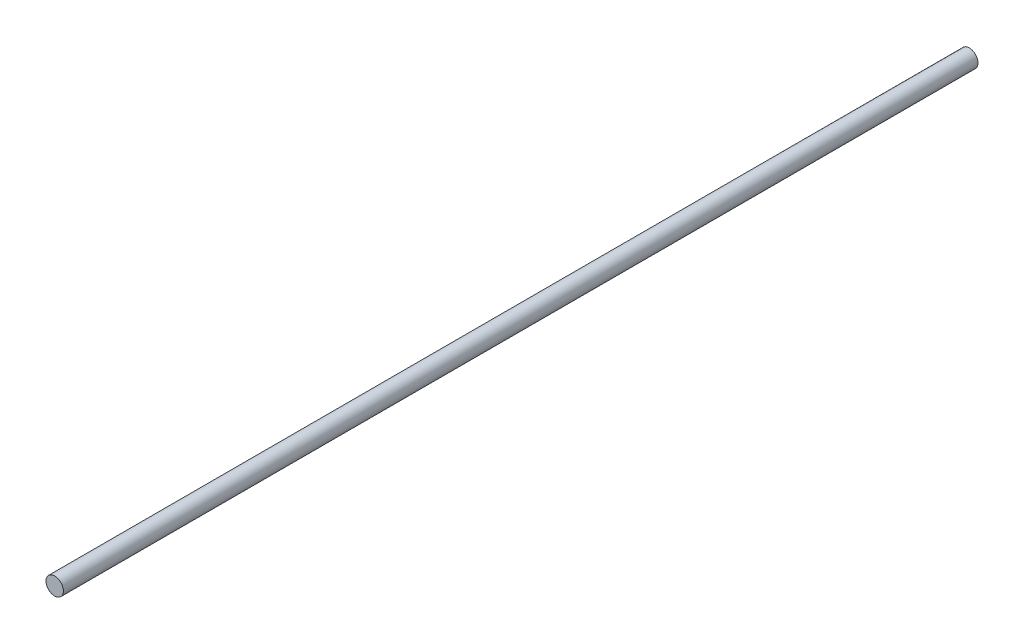
ISO-10303-21;
HEADER;
FILE_DESCRIPTION(('STEP AP214'),'2;1');
FILE_NAME('part.step','',(''),(''),'','','');
FILE_SCHEMA(('AUTOMOTIVE_DESIGN { 1 0 10303 214 1 1 1 1 }'));
ENDSEC;
DATA;
#1=APPLICATION_CONTEXT('core data for automotive mechanical design processes');
#2=APPLICATION_PROTOCOL_DEFINITION('international standard','automotive_design',2000,#1);
#3=PRODUCT_CONTEXT('',#1,'mechanical');
#4=PRODUCT('Part','Part','',(#3));
#5=PRODUCT_RELATED_PRODUCT_CATEGORY('part','',(#4));
#6=PRODUCT_DEFINITION_FORMATION('','',#4);
#7=PRODUCT_DEFINITION_CONTEXT('part definition',#1,'design');
#8=PRODUCT_DEFINITION('design','',#6,#7);
#9=PRODUCT_DEFINITION_SHAPE('','',#8);
#10=(LENGTH_UNIT() NAMED_UNIT(*) SI_UNIT(.MILLI.,.METRE.));
#11=(NAMED_UNIT(*) PLANE_ANGLE_UNIT() SI_UNIT($,.RADIAN.));
#12=(NAMED_UNIT(*) SI_UNIT($,.STERADIAN.) SOLID_ANGLE_UNIT());
#13=UNCERTAINTY_MEASURE_WITH_UNIT(LENGTH_MEASURE(1.E-05),#10,'distance_accuracy_value','');
#14=(GEOMETRIC_REPRESENTATION_CONTEXT(3) GLOBAL_UNCERTAINTY_ASSIGNED_CONTEXT((#13)) GLOBAL_UNIT_ASSIGNED_CONTEXT((#10,
#11,#12)) REPRESENTATION_CONTEXT('',''));
#15=CARTESIAN_POINT('',(0.,0.,0.));
#16=DIRECTION('',(0.,0.,1.));
#17=DIRECTION('',(1.,0.,0.));
#18=AXIS2_PLACEMENT_3D('',#15,#16,#17);
#19=CARTESIAN_POINT('',(0.,0.,500.));
#20=DIRECTION('',(0.,0.,-1.));
#21=DIRECTION('',(-1.,0.,0.));
#22=AXIS2_PLACEMENT_3D('',#19,#20,#21);
#23=CYLINDRICAL_SURFACE('',#22,4.7625);
#24=CARTESIAN_POINT('',(0.,0.,500.));
#25=DIRECTION('',(0.,0.,1.));
#26=DIRECTION('',(1.,0.,0.));
#27=AXIS2_PLACEMENT_3D('',#24,#25,#26);
#28=CIRCLE('',#27,4.7625);
#29=CARTESIAN_POINT('',(4.7625,0.,500.));
#30=VERTEX_POINT('',#29);
#31=EDGE_CURVE('E10',#30,#30,#28,.T.);
#32=ORIENTED_EDGE('',*,*,#31,.F.);
#33=EDGE_LOOP('',(#32));
#34=FACE_BOUND('',#33,.T.);
#35=CARTESIAN_POINT('',(0.,0.,0.));
#36=DIRECTION('',(0.,0.,1.));
#37=DIRECTION('',(1.,0.,0.));
#38=AXIS2_PLACEMENT_3D('',#35,#36,#37);
#39=CIRCLE('',#38,4.7625);
#40=CARTESIAN_POINT('',(4.7625,0.,0.));
#41=VERTEX_POINT('',#40);
#42=EDGE_CURVE('E43',#41,#41,#39,.T.);
#43=ORIENTED_EDGE('',*,*,#42,.T.);
#44=EDGE_LOOP('',(#43));
#45=FACE_BOUND('',#44,.T.);
#46=ADVANCED_FACE('F40',(#34,#45),#23,.T.);
#47=CARTESIAN_POINT('',(0.,0.,500.));
#48=DIRECTION('',(0.,0.,1.));
#49=DIRECTION('',(1.,0.,0.));
#50=AXIS2_PLACEMENT_3D('',#47,#48,#49);
#51=PLANE('',#50);
#52=ORIENTED_EDGE('',*,*,#31,.T.);
#53=EDGE_LOOP('',(#52));
#54=FACE_BOUND('',#53,.T.);
#55=ADVANCED_FACE('F57',(#54),#51,.T.);
#56=CARTESIAN_POINT('',(0.,0.,0.));
#57=DIRECTION('',(0.,0.,1.));
#58=DIRECTION('',(1.,0.,0.));
#59=AXIS2_PLACEMENT_3D('',#56,#57,#58);
#60=PLANE('',#59);
#61=ORIENTED_EDGE('',*,*,#42,.F.);
#62=EDGE_LOOP('',(#61));
#63=FACE_BOUND('',#62,.T.);
#64=ADVANCED_FACE('F55',(#63),#60,.F.);
#65=CLOSED_SHELL('',(#46,#55,#64));
#66=MANIFOLD_SOLID_BREP('B2',#65);
#67=ADVANCED_BREP_SHAPE_REPRESENTATION('',(#18,#66),#14);
#68=SHAPE_DEFINITION_REPRESENTATION(#9,#67);
ENDSEC;
END-ISO-10303-21;
